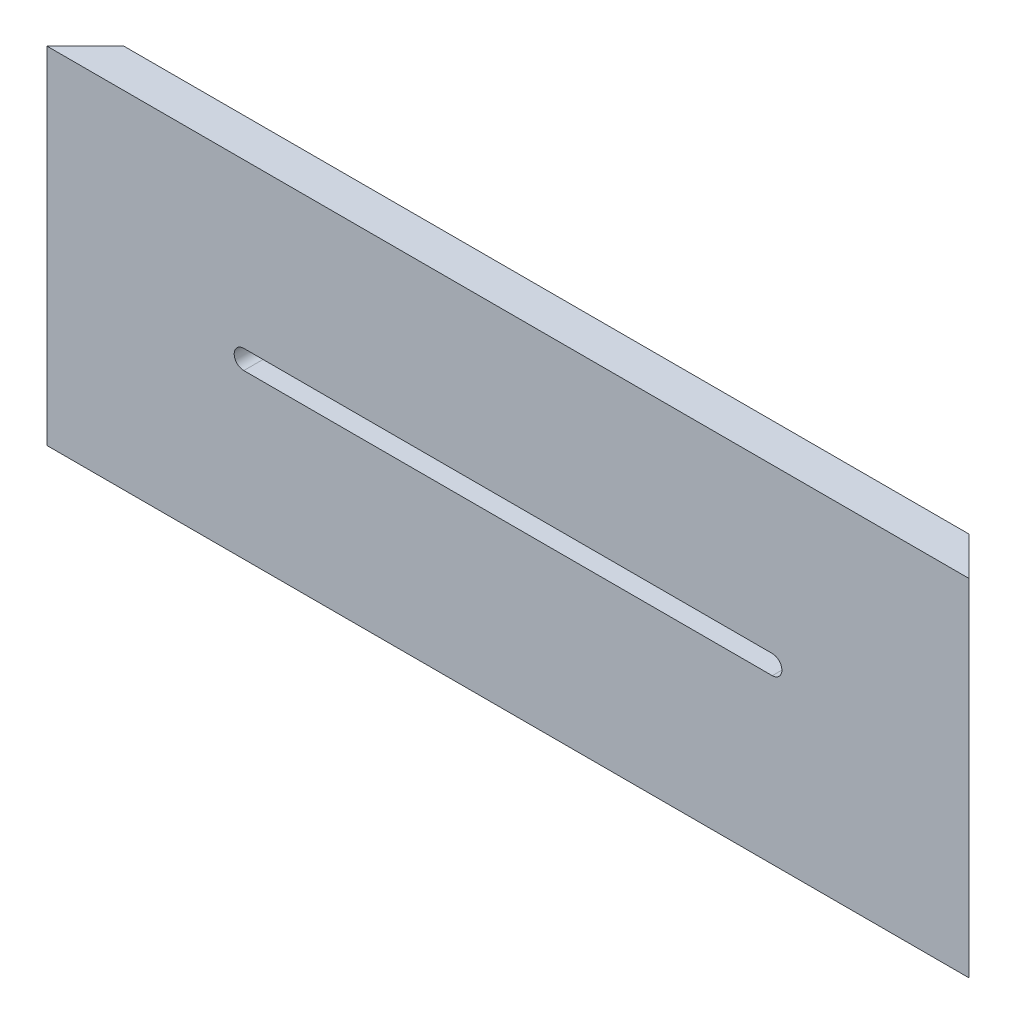
ISO-10303-21;
HEADER;
FILE_DESCRIPTION(('STEP AP214'),'2;1');
FILE_NAME('part.step','',(''),(''),'','','');
FILE_SCHEMA(('AUTOMOTIVE_DESIGN { 1 0 10303 214 1 1 1 1 }'));
ENDSEC;
DATA;
#1=APPLICATION_CONTEXT('core data for automotive mechanical design processes');
#2=APPLICATION_PROTOCOL_DEFINITION('international standard','automotive_design',2000,#1);
#3=PRODUCT_CONTEXT('',#1,'mechanical');
#4=PRODUCT('Part','Part','',(#3));
#5=PRODUCT_RELATED_PRODUCT_CATEGORY('part','',(#4));
#6=PRODUCT_DEFINITION_FORMATION('','',#4);
#7=PRODUCT_DEFINITION_CONTEXT('part definition',#1,'design');
#8=PRODUCT_DEFINITION('design','',#6,#7);
#9=PRODUCT_DEFINITION_SHAPE('','',#8);
#10=(LENGTH_UNIT() NAMED_UNIT(*) SI_UNIT(.MILLI.,.METRE.));
#11=(NAMED_UNIT(*) PLANE_ANGLE_UNIT() SI_UNIT($,.RADIAN.));
#12=(NAMED_UNIT(*) SI_UNIT($,.STERADIAN.) SOLID_ANGLE_UNIT());
#13=UNCERTAINTY_MEASURE_WITH_UNIT(LENGTH_MEASURE(1.E-05),#10,'distance_accuracy_value','');
#14=(GEOMETRIC_REPRESENTATION_CONTEXT(3) GLOBAL_UNCERTAINTY_ASSIGNED_CONTEXT((#13)) GLOBAL_UNIT_ASSIGNED_CONTEXT((#10,
#11,#12)) REPRESENTATION_CONTEXT('',''));
#15=CARTESIAN_POINT('',(0.,0.,0.));
#16=DIRECTION('',(0.,0.,1.));
#17=DIRECTION('',(1.,0.,0.));
#18=AXIS2_PLACEMENT_3D('',#15,#16,#17);
#19=CARTESIAN_POINT('',(0.,0.,-6.35));
#20=DIRECTION('',(0.,0.,-1.));
#21=DIRECTION('',(-1.,0.,0.));
#22=AXIS2_PLACEMENT_3D('',#19,#20,#21);
#23=PLANE('',#22);
#24=CARTESIAN_POINT('',(32.5501,28.575,-6.35));
#25=DIRECTION('',(0.,0.,1.));
#26=DIRECTION('',(1.,0.,0.));
#27=AXIS2_PLACEMENT_3D('',#24,#25,#26);
#28=CIRCLE('',#27,1.58750000000001);
#29=CARTESIAN_POINT('',(32.5501,30.1625,-6.35));
#30=VERTEX_POINT('',#29);
#31=CARTESIAN_POINT('',(32.5501,26.9875,-6.35));
#32=VERTEX_POINT('',#31);
#33=EDGE_CURVE('E372',#30,#32,#28,.T.);
#34=ORIENTED_EDGE('',*,*,#33,.T.);
#35=DIRECTION('',(1.,0.,0.));
#36=VECTOR('',#35,1.);
#37=CARTESIAN_POINT('',(32.5501,26.9875,-6.35));
#38=LINE('',#37,#36);
#39=CARTESIAN_POINT('',(119.8626,26.9875,-6.35));
#40=VERTEX_POINT('',#39);
#41=EDGE_CURVE('E375',#32,#40,#38,.T.);
#42=ORIENTED_EDGE('',*,*,#41,.T.);
#43=CARTESIAN_POINT('',(119.8626,28.575,-6.35));
#44=DIRECTION('',(0.,0.,1.));
#45=DIRECTION('',(1.,0.,0.));
#46=AXIS2_PLACEMENT_3D('',#43,#44,#45);
#47=CIRCLE('',#46,1.58750000000001);
#48=CARTESIAN_POINT('',(119.8626,30.1625,-6.35));
#49=VERTEX_POINT('',#48);
#50=EDGE_CURVE('E380',#40,#49,#47,.T.);
#51=ORIENTED_EDGE('',*,*,#50,.T.);
#52=DIRECTION('',(-1.,0.,0.));
#53=VECTOR('',#52,1.);
#54=CARTESIAN_POINT('',(32.5501,30.1625,-6.35));
#55=LINE('',#54,#53);
#56=EDGE_CURVE('E384',#49,#30,#55,.T.);
#57=ORIENTED_EDGE('',*,*,#56,.T.);
#58=EDGE_LOOP('',(#34,#42,#51,#57));
#59=FACE_BOUND('',#58,.T.);
#60=DIRECTION('',(0.,1.,0.));
#61=VECTOR('',#60,1.);
#62=CARTESIAN_POINT('',(146.05,0.,-6.35));
#63=LINE('',#62,#61);
#64=CARTESIAN_POINT('',(146.05,8.0137,-6.35));
#65=VERTEX_POINT('',#64);
#66=CARTESIAN_POINT('',(146.05,41.5925,-6.35));
#67=VERTEX_POINT('',#66);
#68=EDGE_CURVE('E178',#65,#67,#63,.T.);
#69=ORIENTED_EDGE('',*,*,#68,.F.);
#70=DIRECTION('',(-1.,0.,0.));
#71=VECTOR('',#70,1.);
#72=CARTESIAN_POINT('',(152.4,8.01370000000001,-6.35));
#73=LINE('',#72,#71);
#74=CARTESIAN_POINT('',(6.34999999999994,8.01370000000001,-6.35000000000001));
#75=VERTEX_POINT('',#74);
#76=EDGE_CURVE('E235',#65,#75,#73,.T.);
#77=ORIENTED_EDGE('',*,*,#76,.T.);
#78=DIRECTION('',(0.,1.,0.));
#79=VECTOR('',#78,1.);
#80=CARTESIAN_POINT('',(6.3499999999999,0.,-6.35));
#81=LINE('',#80,#79);
#82=CARTESIAN_POINT('',(6.34999999999994,41.5925,-6.35000000000001));
#83=VERTEX_POINT('',#82);
#84=EDGE_CURVE('E318',#75,#83,#81,.T.);
#85=ORIENTED_EDGE('',*,*,#84,.T.);
#86=DIRECTION('',(-1.,0.,0.));
#87=VECTOR('',#86,1.);
#88=CARTESIAN_POINT('',(152.4,41.5925,-6.35));
#89=LINE('',#88,#87);
#90=EDGE_CURVE('E222',#67,#83,#89,.T.);
#91=ORIENTED_EDGE('',*,*,#90,.F.);
#92=EDGE_LOOP('',(#69,#77,#85,#91));
#93=FACE_BOUND('',#92,.T.);
#94=ADVANCED_FACE('F38',(#59,#93),#23,.T.);
#95=CARTESIAN_POINT('',(6.3499999999999,0.,-6.35));
#96=VERTEX_POINT('',#95);
#97=CARTESIAN_POINT('',(6.34999999999994,4.7625,-6.35));
#98=VERTEX_POINT('',#97);
#99=EDGE_CURVE('E168',#96,#98,#81,.T.);
#100=ORIENTED_EDGE('',*,*,#99,.T.);
#101=DIRECTION('',(-1.,0.,0.));
#102=VECTOR('',#101,1.);
#103=CARTESIAN_POINT('',(152.4,4.7625,-6.35));
#104=LINE('',#103,#102);
#105=CARTESIAN_POINT('',(146.05,4.7625,-6.35));
#106=VERTEX_POINT('',#105);
#107=EDGE_CURVE('E153',#106,#98,#104,.T.);
#108=ORIENTED_EDGE('',*,*,#107,.F.);
#109=CARTESIAN_POINT('',(146.05,0.,-6.35));
#110=VERTEX_POINT('',#109);
#111=EDGE_CURVE('E166',#110,#106,#63,.T.);
#112=ORIENTED_EDGE('',*,*,#111,.F.);
#113=DIRECTION('',(1.,0.,0.));
#114=VECTOR('',#113,1.);
#115=CARTESIAN_POINT('',(0.,0.,-6.35));
#116=LINE('',#115,#114);
#117=EDGE_CURVE('E277',#96,#110,#116,.T.);
#118=ORIENTED_EDGE('',*,*,#117,.F.);
#119=EDGE_LOOP('',(#100,#108,#112,#118));
#120=FACE_BOUND('',#119,.T.);
#121=ADVANCED_FACE('F164',(#120),#23,.T.);
#122=CARTESIAN_POINT('',(0.,0.,0.));
#123=DIRECTION('',(0.707106781186552,0.,0.707106781186542));
#124=DIRECTION('',(0.707106781186543,0.,-0.707106781186552));
#125=AXIS2_PLACEMENT_3D('',#122,#123,#124);
#126=PLANE('',#125);
#127=DIRECTION('',(0.707106781186543,0.,-0.707106781186552));
#128=VECTOR('',#127,1.);
#129=CARTESIAN_POINT('',(0.,8.0137,0.));
#130=LINE('',#129,#128);
#131=CARTESIAN_POINT('',(3.17500000000001,8.01369999999998,-3.175));
#132=VERTEX_POINT('',#131);
#133=EDGE_CURVE('E226',#132,#75,#130,.T.);
#134=ORIENTED_EDGE('',*,*,#133,.F.);
#135=DIRECTION('',(0.,1.,0.));
#136=VECTOR('',#135,1.);
#137=CARTESIAN_POINT('',(3.17499999999997,0.,-3.175));
#138=LINE('',#137,#136);
#139=CARTESIAN_POINT('',(3.17500000000001,4.7625,-3.17500000000001));
#140=VERTEX_POINT('',#139);
#141=EDGE_CURVE('E229',#140,#132,#138,.T.);
#142=ORIENTED_EDGE('',*,*,#141,.F.);
#143=DIRECTION('',(-0.707106781186543,0.,0.707106781186552));
#144=VECTOR('',#143,1.);
#145=CARTESIAN_POINT('',(0.,4.7625,0.));
#146=LINE('',#145,#144);
#147=EDGE_CURVE('E232',#98,#140,#146,.T.);
#148=ORIENTED_EDGE('',*,*,#147,.F.);
#149=ORIENTED_EDGE('',*,*,#99,.F.);
#150=DIRECTION('',(0.707106781186542,0.,-0.707106781186552));
#151=VECTOR('',#150,1.);
#152=CARTESIAN_POINT('',(0.,0.,0.));
#153=LINE('',#152,#151);
#154=CARTESIAN_POINT('',(0.,0.,0.));
#155=VERTEX_POINT('',#154);
#156=EDGE_CURVE('E363',#155,#96,#153,.T.);
#157=ORIENTED_EDGE('',*,*,#156,.F.);
#158=DIRECTION('',(0.,-1.,0.));
#159=VECTOR('',#158,1.);
#160=CARTESIAN_POINT('',(0.,0.,0.));
#161=LINE('',#160,#159);
#162=CARTESIAN_POINT('',(0.,57.15,0.));
#163=VERTEX_POINT('',#162);
#164=EDGE_CURVE('E288',#163,#155,#161,.T.);
#165=ORIENTED_EDGE('',*,*,#164,.F.);
#166=DIRECTION('',(0.707106781186542,0.,-0.707106781186552));
#167=VECTOR('',#166,1.);
#168=CARTESIAN_POINT('',(0.,57.15,0.));
#169=LINE('',#168,#167);
#170=CARTESIAN_POINT('',(6.34999999999991,57.15,-6.35));
#171=VERTEX_POINT('',#170);
#172=EDGE_CURVE('E205',#163,#171,#169,.T.);
#173=ORIENTED_EDGE('',*,*,#172,.T.);
#174=CARTESIAN_POINT('',(6.34999999999993,46.355,-6.35000000000001));
#175=VERTEX_POINT('',#174);
#176=EDGE_CURVE('E271',#175,#171,#81,.T.);
#177=ORIENTED_EDGE('',*,*,#176,.F.);
#178=DIRECTION('',(0.707106781186543,0.,-0.707106781186552));
#179=VECTOR('',#178,1.);
#180=CARTESIAN_POINT('',(0.,46.355,0.));
#181=LINE('',#180,#179);
#182=CARTESIAN_POINT('',(3.175,46.355,-3.175));
#183=VERTEX_POINT('',#182);
#184=EDGE_CURVE('E202',#183,#175,#181,.T.);
#185=ORIENTED_EDGE('',*,*,#184,.F.);
#186=DIRECTION('',(0.,1.,0.));
#187=VECTOR('',#186,1.);
#188=CARTESIAN_POINT('',(3.17499999999997,0.,-3.175));
#189=LINE('',#188,#187);
#190=CARTESIAN_POINT('',(3.17499999999998,41.5925,-3.17500000000001));
#191=VERTEX_POINT('',#190);
#192=EDGE_CURVE('E206',#191,#183,#189,.T.);
#193=ORIENTED_EDGE('',*,*,#192,.F.);
#194=DIRECTION('',(-0.707106781186543,0.,0.707106781186552));
#195=VECTOR('',#194,1.);
#196=CARTESIAN_POINT('',(0.,41.5925,0.));
#197=LINE('',#196,#195);
#198=EDGE_CURVE('E209',#83,#191,#197,.T.);
#199=ORIENTED_EDGE('',*,*,#198,.F.);
#200=ORIENTED_EDGE('',*,*,#84,.F.);
#201=EDGE_LOOP('',(#134,#142,#148,#149,#157,#165,#173,#177,#185,#193,#199,#200));
#202=FACE_BOUND('',#201,.T.);
#203=ADVANCED_FACE('F324',(#202),#126,.F.);
#204=CARTESIAN_POINT('',(152.4,0.,0.));
#205=DIRECTION('',(-0.707106781186543,0.,0.707106781186552));
#206=DIRECTION('',(0.707106781186552,0.,0.707106781186543));
#207=AXIS2_PLACEMENT_3D('',#204,#205,#206);
#208=PLANE('',#207);
#209=DIRECTION('',(0.707106781186552,0.,0.707106781186543));
#210=VECTOR('',#209,1.);
#211=CARTESIAN_POINT('',(152.4,8.01370000000001,0.));
#212=LINE('',#211,#210);
#213=CARTESIAN_POINT('',(149.225,8.0137,-3.175));
#214=VERTEX_POINT('',#213);
#215=EDGE_CURVE('E11',#65,#214,#212,.T.);
#216=ORIENTED_EDGE('',*,*,#215,.F.);
#217=ORIENTED_EDGE('',*,*,#68,.T.);
#218=DIRECTION('',(-0.707106781186552,0.,-0.707106781186543));
#219=VECTOR('',#218,1.);
#220=CARTESIAN_POINT('',(152.4,41.5925,0.));
#221=LINE('',#220,#219);
#222=CARTESIAN_POINT('',(149.225,41.5925,-3.175));
#223=VERTEX_POINT('',#222);
#224=EDGE_CURVE('E276',#223,#67,#221,.T.);
#225=ORIENTED_EDGE('',*,*,#224,.F.);
#226=DIRECTION('',(0.,-1.,0.));
#227=VECTOR('',#226,1.);
#228=CARTESIAN_POINT('',(149.225,0.,-3.17500000000001));
#229=LINE('',#228,#227);
#230=CARTESIAN_POINT('',(149.225,46.355,-3.175));
#231=VERTEX_POINT('',#230);
#232=EDGE_CURVE('E282',#231,#223,#229,.T.);
#233=ORIENTED_EDGE('',*,*,#232,.F.);
#234=DIRECTION('',(0.707106781186552,0.,0.707106781186543));
#235=VECTOR('',#234,1.);
#236=CARTESIAN_POINT('',(152.4,46.355,0.));
#237=LINE('',#236,#235);
#238=CARTESIAN_POINT('',(146.05,46.355,-6.35));
#239=VERTEX_POINT('',#238);
#240=EDGE_CURVE('E159',#239,#231,#237,.T.);
#241=ORIENTED_EDGE('',*,*,#240,.F.);
#242=CARTESIAN_POINT('',(146.05,57.15,-6.35));
#243=VERTEX_POINT('',#242);
#244=EDGE_CURVE('E180',#239,#243,#63,.T.);
#245=ORIENTED_EDGE('',*,*,#244,.T.);
#246=DIRECTION('',(0.707106781186552,0.,0.707106781186543));
#247=VECTOR('',#246,1.);
#248=CARTESIAN_POINT('',(152.4,57.15,0.));
#249=LINE('',#248,#247);
#250=CARTESIAN_POINT('',(152.4,57.15,0.));
#251=VERTEX_POINT('',#250);
#252=EDGE_CURVE('E194',#243,#251,#249,.T.);
#253=ORIENTED_EDGE('',*,*,#252,.T.);
#254=DIRECTION('',(0.,1.,0.));
#255=VECTOR('',#254,1.);
#256=CARTESIAN_POINT('',(152.4,0.,0.));
#257=LINE('',#256,#255);
#258=CARTESIAN_POINT('',(152.4,0.,0.));
#259=VERTEX_POINT('',#258);
#260=EDGE_CURVE('E296',#259,#251,#257,.T.);
#261=ORIENTED_EDGE('',*,*,#260,.F.);
#262=DIRECTION('',(0.707106781186552,0.,0.707106781186543));
#263=VECTOR('',#262,1.);
#264=CARTESIAN_POINT('',(152.4,0.,0.));
#265=LINE('',#264,#263);
#266=EDGE_CURVE('E175',#110,#259,#265,.T.);
#267=ORIENTED_EDGE('',*,*,#266,.F.);
#268=ORIENTED_EDGE('',*,*,#111,.T.);
#269=DIRECTION('',(-0.707106781186552,0.,-0.707106781186543));
#270=VECTOR('',#269,1.);
#271=CARTESIAN_POINT('',(152.4,4.7625,0.));
#272=LINE('',#271,#270);
#273=CARTESIAN_POINT('',(149.225,4.7625,-3.175));
#274=VERTEX_POINT('',#273);
#275=EDGE_CURVE('E150',#274,#106,#272,.T.);
#276=ORIENTED_EDGE('',*,*,#275,.F.);
#277=DIRECTION('',(0.,-1.,0.));
#278=VECTOR('',#277,1.);
#279=CARTESIAN_POINT('',(149.225,0.,-3.175));
#280=LINE('',#279,#278);
#281=EDGE_CURVE('E47',#214,#274,#280,.T.);
#282=ORIENTED_EDGE('',*,*,#281,.F.);
#283=EDGE_LOOP('',(#216,#217,#225,#233,#241,#245,#253,#261,#267,#268,#276,#282));
#284=FACE_BOUND('',#283,.T.);
#285=ADVANCED_FACE('F173',(#284),#208,.F.);
#286=CARTESIAN_POINT('',(9.65199999999999,49.911,-6.35));
#287=DIRECTION('',(0.,0.,-1.));
#288=DIRECTION('',(-1.,0.,0.));
#289=AXIS2_PLACEMENT_3D('',#286,#287,#288);
#290=CIRCLE('',#289,2.3876);
#291=CARTESIAN_POINT('',(7.2644,49.911,-6.35));
#292=VERTEX_POINT('',#291);
#293=EDGE_CURVE('E245',#292,#292,#290,.T.);
#294=ORIENTED_EDGE('',*,*,#293,.F.);
#295=EDGE_LOOP('',(#294));
#296=FACE_BOUND('',#295,.T.);
#297=ORIENTED_EDGE('',*,*,#244,.F.);
#298=DIRECTION('',(-1.,0.,0.));
#299=VECTOR('',#298,1.);
#300=CARTESIAN_POINT('',(152.4,46.355,-6.35));
#301=LINE('',#300,#299);
#302=EDGE_CURVE('E212',#239,#175,#301,.T.);
#303=ORIENTED_EDGE('',*,*,#302,.T.);
#304=ORIENTED_EDGE('',*,*,#176,.T.);
#305=DIRECTION('',(-1.,0.,0.));
#306=VECTOR('',#305,1.);
#307=CARTESIAN_POINT('',(0.,57.15,-6.35));
#308=LINE('',#307,#306);
#309=EDGE_CURVE('E270',#243,#171,#308,.T.);
#310=ORIENTED_EDGE('',*,*,#309,.F.);
#311=EDGE_LOOP('',(#297,#303,#304,#310));
#312=FACE_BOUND('',#311,.T.);
#313=ADVANCED_FACE('F262',(#296,#312),#23,.T.);
#314=CARTESIAN_POINT('',(0.,57.15,-6.35));
#315=DIRECTION('',(0.,1.,0.));
#316=DIRECTION('',(0.,0.,1.));
#317=AXIS2_PLACEMENT_3D('',#314,#315,#316);
#318=PLANE('',#317);
#319=ORIENTED_EDGE('',*,*,#252,.F.);
#320=ORIENTED_EDGE('',*,*,#309,.T.);
#321=ORIENTED_EDGE('',*,*,#172,.F.);
#322=DIRECTION('',(-1.,0.,0.));
#323=VECTOR('',#322,1.);
#324=CARTESIAN_POINT('',(0.,57.15,0.));
#325=LINE('',#324,#323);
#326=EDGE_CURVE('E284',#251,#163,#325,.T.);
#327=ORIENTED_EDGE('',*,*,#326,.F.);
#328=EDGE_LOOP('',(#319,#320,#321,#327));
#329=FACE_BOUND('',#328,.T.);
#330=ADVANCED_FACE('F265',(#329),#318,.T.);
#331=CARTESIAN_POINT('',(0.,0.,-6.35));
#332=DIRECTION('',(0.,-1.,0.));
#333=DIRECTION('',(0.,0.,-1.));
#334=AXIS2_PLACEMENT_3D('',#331,#332,#333);
#335=PLANE('',#334);
#336=ORIENTED_EDGE('',*,*,#266,.T.);
#337=DIRECTION('',(1.,0.,0.));
#338=VECTOR('',#337,1.);
#339=CARTESIAN_POINT('',(0.,0.,0.));
#340=LINE('',#339,#338);
#341=EDGE_CURVE('E292',#155,#259,#340,.T.);
#342=ORIENTED_EDGE('',*,*,#341,.F.);
#343=ORIENTED_EDGE('',*,*,#156,.T.);
#344=ORIENTED_EDGE('',*,*,#117,.T.);
#345=EDGE_LOOP('',(#336,#342,#343,#344));
#346=FACE_BOUND('',#345,.T.);
#347=ADVANCED_FACE('F40',(#346),#335,.T.);
#348=CARTESIAN_POINT('',(0.,0.,0.));
#349=DIRECTION('',(0.,0.,-1.));
#350=DIRECTION('',(-1.,0.,0.));
#351=AXIS2_PLACEMENT_3D('',#348,#349,#350);
#352=PLANE('',#351);
#353=DIRECTION('',(1.,0.,0.));
#354=VECTOR('',#353,1.);
#355=CARTESIAN_POINT('',(32.5501,26.9875,0.));
#356=LINE('',#355,#354);
#357=CARTESIAN_POINT('',(32.5501,26.9875,0.));
#358=VERTEX_POINT('',#357);
#359=CARTESIAN_POINT('',(119.8626,26.9875,0.));
#360=VERTEX_POINT('',#359);
#361=EDGE_CURVE('E184',#358,#360,#356,.T.);
#362=ORIENTED_EDGE('',*,*,#361,.F.);
#363=CARTESIAN_POINT('',(32.5501,28.575,0.));
#364=DIRECTION('',(0.,0.,1.));
#365=DIRECTION('',(1.,0.,0.));
#366=AXIS2_PLACEMENT_3D('',#363,#364,#365);
#367=CIRCLE('',#366,1.58750000000001);
#368=CARTESIAN_POINT('',(32.5501,30.1625,0.));
#369=VERTEX_POINT('',#368);
#370=EDGE_CURVE('E177',#369,#358,#367,.T.);
#371=ORIENTED_EDGE('',*,*,#370,.F.);
#372=DIRECTION('',(-1.,0.,0.));
#373=VECTOR('',#372,1.);
#374=CARTESIAN_POINT('',(32.5501,30.1625,0.));
#375=LINE('',#374,#373);
#376=CARTESIAN_POINT('',(119.8626,30.1625,0.));
#377=VERTEX_POINT('',#376);
#378=EDGE_CURVE('E376',#377,#369,#375,.T.);
#379=ORIENTED_EDGE('',*,*,#378,.F.);
#380=CARTESIAN_POINT('',(119.8626,28.575,0.));
#381=DIRECTION('',(0.,0.,1.));
#382=DIRECTION('',(1.,0.,0.));
#383=AXIS2_PLACEMENT_3D('',#380,#381,#382);
#384=CIRCLE('',#383,1.58750000000001);
#385=EDGE_CURVE('E392',#360,#377,#384,.T.);
#386=ORIENTED_EDGE('',*,*,#385,.F.);
#387=EDGE_LOOP('',(#362,#371,#379,#386));
#388=FACE_BOUND('',#387,.T.);
#389=ORIENTED_EDGE('',*,*,#164,.T.);
#390=ORIENTED_EDGE('',*,*,#341,.T.);
#391=ORIENTED_EDGE('',*,*,#260,.T.);
#392=ORIENTED_EDGE('',*,*,#326,.T.);
#393=EDGE_LOOP('',(#389,#390,#391,#392));
#394=FACE_BOUND('',#393,.T.);
#395=ADVANCED_FACE('F353',(#388,#394),#352,.F.);
#396=CARTESIAN_POINT('',(32.5501,28.575,-6.35));
#397=DIRECTION('',(0.,0.,1.));
#398=DIRECTION('',(1.,0.,0.));
#399=AXIS2_PLACEMENT_3D('',#396,#397,#398);
#400=CYLINDRICAL_SURFACE('',#399,1.58750000000001);
#401=ORIENTED_EDGE('',*,*,#370,.T.);
#402=DIRECTION('',(0.,0.,1.));
#403=VECTOR('',#402,1.);
#404=CARTESIAN_POINT('',(32.5501,26.9875,-6.35));
#405=LINE('',#404,#403);
#406=EDGE_CURVE('E387',#32,#358,#405,.T.);
#407=ORIENTED_EDGE('',*,*,#406,.F.);
#408=ORIENTED_EDGE('',*,*,#33,.F.);
#409=DIRECTION('',(0.,0.,1.));
#410=VECTOR('',#409,1.);
#411=CARTESIAN_POINT('',(32.5501,30.1625,-6.35));
#412=LINE('',#411,#410);
#413=EDGE_CURVE('E293',#30,#369,#412,.T.);
#414=ORIENTED_EDGE('',*,*,#413,.T.);
#415=EDGE_LOOP('',(#401,#407,#408,#414));
#416=FACE_BOUND('',#415,.T.);
#417=ADVANCED_FACE('F352',(#416),#400,.F.);
#418=CARTESIAN_POINT('',(32.5501,30.1625,-6.35));
#419=DIRECTION('',(0.,1.,0.));
#420=DIRECTION('',(0.,0.,1.));
#421=AXIS2_PLACEMENT_3D('',#418,#419,#420);
#422=PLANE('',#421);
#423=ORIENTED_EDGE('',*,*,#378,.T.);
#424=ORIENTED_EDGE('',*,*,#413,.F.);
#425=ORIENTED_EDGE('',*,*,#56,.F.);
#426=DIRECTION('',(0.,0.,1.));
#427=VECTOR('',#426,1.);
#428=CARTESIAN_POINT('',(119.8626,30.1625,-6.35));
#429=LINE('',#428,#427);
#430=EDGE_CURVE('E401',#49,#377,#429,.T.);
#431=ORIENTED_EDGE('',*,*,#430,.T.);
#432=EDGE_LOOP('',(#423,#424,#425,#431));
#433=FACE_BOUND('',#432,.T.);
#434=ADVANCED_FACE('F420',(#433),#422,.F.);
#435=CARTESIAN_POINT('',(119.8626,28.575,-6.35));
#436=DIRECTION('',(0.,0.,1.));
#437=DIRECTION('',(1.,0.,0.));
#438=AXIS2_PLACEMENT_3D('',#435,#436,#437);
#439=CYLINDRICAL_SURFACE('',#438,1.58750000000001);
#440=ORIENTED_EDGE('',*,*,#385,.T.);
#441=ORIENTED_EDGE('',*,*,#430,.F.);
#442=ORIENTED_EDGE('',*,*,#50,.F.);
#443=DIRECTION('',(0.,0.,1.));
#444=VECTOR('',#443,1.);
#445=CARTESIAN_POINT('',(119.8626,26.9875,-6.35));
#446=LINE('',#445,#444);
#447=EDGE_CURVE('E404',#40,#360,#446,.T.);
#448=ORIENTED_EDGE('',*,*,#447,.T.);
#449=EDGE_LOOP('',(#440,#441,#442,#448));
#450=FACE_BOUND('',#449,.T.);
#451=ADVANCED_FACE('F340',(#450),#439,.F.);
#452=CARTESIAN_POINT('',(32.5501,26.9875,-6.35));
#453=DIRECTION('',(0.,-1.,0.));
#454=DIRECTION('',(0.,0.,-1.));
#455=AXIS2_PLACEMENT_3D('',#452,#453,#454);
#456=PLANE('',#455);
#457=ORIENTED_EDGE('',*,*,#361,.T.);
#458=ORIENTED_EDGE('',*,*,#447,.F.);
#459=ORIENTED_EDGE('',*,*,#41,.F.);
#460=ORIENTED_EDGE('',*,*,#406,.T.);
#461=EDGE_LOOP('',(#457,#458,#459,#460));
#462=FACE_BOUND('',#461,.T.);
#463=ADVANCED_FACE('F333',(#462),#456,.F.);
#464=CARTESIAN_POINT('',(152.4,46.355,-6.35));
#465=DIRECTION('',(0.,-1.,0.));
#466=DIRECTION('',(0.,0.,-1.));
#467=AXIS2_PLACEMENT_3D('',#464,#465,#466);
#468=PLANE('',#467);
#469=ORIENTED_EDGE('',*,*,#184,.T.);
#470=ORIENTED_EDGE('',*,*,#302,.F.);
#471=ORIENTED_EDGE('',*,*,#240,.T.);
#472=DIRECTION('',(-1.,0.,0.));
#473=VECTOR('',#472,1.);
#474=CARTESIAN_POINT('',(152.4,46.355,-3.175));
#475=LINE('',#474,#473);
#476=EDGE_CURVE('E216',#231,#183,#475,.T.);
#477=ORIENTED_EDGE('',*,*,#476,.T.);
#478=EDGE_LOOP('',(#469,#470,#471,#477));
#479=FACE_BOUND('',#478,.T.);
#480=ADVANCED_FACE('F331',(#479),#468,.T.);
#481=CARTESIAN_POINT('',(152.4,46.355,-3.175));
#482=DIRECTION('',(0.,0.,-1.));
#483=DIRECTION('',(0.,1.,0.));
#484=AXIS2_PLACEMENT_3D('',#481,#482,#483);
#485=PLANE('',#484);
#486=ORIENTED_EDGE('',*,*,#192,.T.);
#487=ORIENTED_EDGE('',*,*,#476,.F.);
#488=ORIENTED_EDGE('',*,*,#232,.T.);
#489=DIRECTION('',(-1.,0.,0.));
#490=VECTOR('',#489,1.);
#491=CARTESIAN_POINT('',(152.4,41.5925,-3.175));
#492=LINE('',#491,#490);
#493=EDGE_CURVE('E62',#223,#191,#492,.T.);
#494=ORIENTED_EDGE('',*,*,#493,.T.);
#495=EDGE_LOOP('',(#486,#487,#488,#494));
#496=FACE_BOUND('',#495,.T.);
#497=ADVANCED_FACE('F328',(#496),#485,.T.);
#498=CARTESIAN_POINT('',(152.4,41.5925,-3.175));
#499=DIRECTION('',(0.,1.,0.));
#500=DIRECTION('',(0.,0.,1.));
#501=AXIS2_PLACEMENT_3D('',#498,#499,#500);
#502=PLANE('',#501);
#503=ORIENTED_EDGE('',*,*,#198,.T.);
#504=ORIENTED_EDGE('',*,*,#493,.F.);
#505=ORIENTED_EDGE('',*,*,#224,.T.);
#506=ORIENTED_EDGE('',*,*,#90,.T.);
#507=EDGE_LOOP('',(#503,#504,#505,#506));
#508=FACE_BOUND('',#507,.T.);
#509=ADVANCED_FACE('F320',(#508),#502,.T.);
#510=CARTESIAN_POINT('',(152.4,8.01370000000001,-3.175));
#511=DIRECTION('',(0.,-1.,0.));
#512=DIRECTION('',(0.,0.,-1.));
#513=AXIS2_PLACEMENT_3D('',#510,#511,#512);
#514=PLANE('',#513);
#515=ORIENTED_EDGE('',*,*,#133,.T.);
#516=ORIENTED_EDGE('',*,*,#76,.F.);
#517=ORIENTED_EDGE('',*,*,#215,.T.);
#518=DIRECTION('',(-1.,0.,0.));
#519=VECTOR('',#518,1.);
#520=CARTESIAN_POINT('',(152.4,8.01370000000001,-3.175));
#521=LINE('',#520,#519);
#522=EDGE_CURVE('E239',#214,#132,#521,.T.);
#523=ORIENTED_EDGE('',*,*,#522,.T.);
#524=EDGE_LOOP('',(#515,#516,#517,#523));
#525=FACE_BOUND('',#524,.T.);
#526=ADVANCED_FACE('F482',(#525),#514,.T.);
#527=CARTESIAN_POINT('',(152.4,4.7625,-3.175));
#528=DIRECTION('',(0.,0.,-1.));
#529=DIRECTION('',(-1.,0.,0.));
#530=AXIS2_PLACEMENT_3D('',#527,#528,#529);
#531=PLANE('',#530);
#532=ORIENTED_EDGE('',*,*,#141,.T.);
#533=ORIENTED_EDGE('',*,*,#522,.F.);
#534=ORIENTED_EDGE('',*,*,#281,.T.);
#535=DIRECTION('',(-1.,0.,0.));
#536=VECTOR('',#535,1.);
#537=CARTESIAN_POINT('',(152.4,4.7625,-3.175));
#538=LINE('',#537,#536);
#539=EDGE_CURVE('E54',#274,#140,#538,.T.);
#540=ORIENTED_EDGE('',*,*,#539,.T.);
#541=EDGE_LOOP('',(#532,#533,#534,#540));
#542=FACE_BOUND('',#541,.T.);
#543=ADVANCED_FACE('F310',(#542),#531,.T.);
#544=CARTESIAN_POINT('',(152.4,4.7625,-6.35));
#545=DIRECTION('',(0.,1.,0.));
#546=DIRECTION('',(0.,0.,1.));
#547=AXIS2_PLACEMENT_3D('',#544,#545,#546);
#548=PLANE('',#547);
#549=ORIENTED_EDGE('',*,*,#147,.T.);
#550=ORIENTED_EDGE('',*,*,#539,.F.);
#551=ORIENTED_EDGE('',*,*,#275,.T.);
#552=ORIENTED_EDGE('',*,*,#107,.T.);
#553=EDGE_LOOP('',(#549,#550,#551,#552));
#554=FACE_BOUND('',#553,.T.);
#555=ADVANCED_FACE('F152',(#554),#548,.T.);
#556=CARTESIAN_POINT('',(9.65199999999999,49.911,-1.27));
#557=DIRECTION('',(0.,0.,-1.));
#558=DIRECTION('',(-1.,0.,0.));
#559=AXIS2_PLACEMENT_3D('',#556,#557,#558);
#560=CYLINDRICAL_SURFACE('',#559,2.3876);
#561=CARTESIAN_POINT('',(9.65199999999999,49.911,-1.27));
#562=DIRECTION('',(0.,0.,-1.));
#563=DIRECTION('',(-1.,0.,0.));
#564=AXIS2_PLACEMENT_3D('',#561,#562,#563);
#565=CIRCLE('',#564,2.3876);
#566=CARTESIAN_POINT('',(7.2644,49.911,-1.27));
#567=VERTEX_POINT('',#566);
#568=EDGE_CURVE('E170',#567,#567,#565,.T.);
#569=ORIENTED_EDGE('',*,*,#568,.F.);
#570=EDGE_LOOP('',(#569));
#571=FACE_BOUND('',#570,.T.);
#572=ORIENTED_EDGE('',*,*,#293,.T.);
#573=EDGE_LOOP('',(#572));
#574=FACE_BOUND('',#573,.T.);
#575=ADVANCED_FACE('F256',(#571,#574),#560,.F.);
#576=CARTESIAN_POINT('',(9.65199999999999,49.911,-1.27));
#577=DIRECTION('',(0.,0.,-1.));
#578=DIRECTION('',(-1.,0.,0.));
#579=AXIS2_PLACEMENT_3D('',#576,#577,#578);
#580=PLANE('',#579);
#581=ORIENTED_EDGE('',*,*,#568,.T.);
#582=EDGE_LOOP('',(#581));
#583=FACE_BOUND('',#582,.T.);
#584=ADVANCED_FACE('F254',(#583),#580,.T.);
#585=CLOSED_SHELL('',(#94,#121,#203,#285,#313,#330,#347,#395,#417,#434,#451,#463,#480,#497,#509,
#526,#543,#555,#575,#584));
#586=MANIFOLD_SOLID_BREP('B2',#585);
#587=ADVANCED_BREP_SHAPE_REPRESENTATION('',(#18,#586),#14);
#588=SHAPE_DEFINITION_REPRESENTATION(#9,#587);
ENDSEC;
END-ISO-10303-21;
